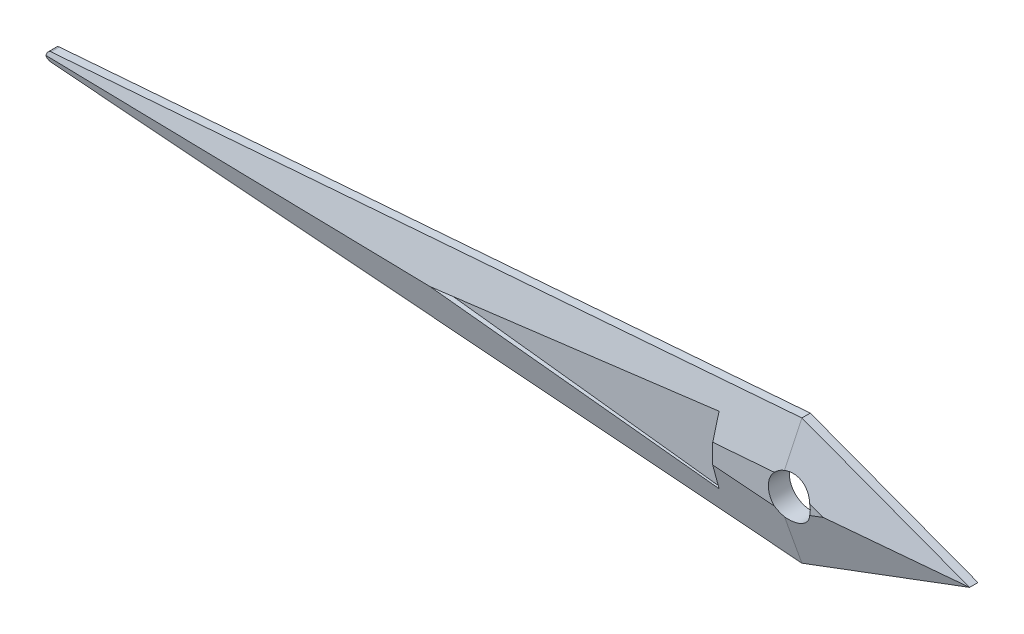
ISO-10303-21;
HEADER;
FILE_DESCRIPTION(('STEP AP214'),'2;1');
FILE_NAME('part.step','',(''),(''),'','','');
FILE_SCHEMA(('AUTOMOTIVE_DESIGN { 1 0 10303 214 1 1 1 1 }'));
ENDSEC;
DATA;
#1=APPLICATION_CONTEXT('core data for automotive mechanical design processes');
#2=APPLICATION_PROTOCOL_DEFINITION('international standard','automotive_design',2000,#1);
#3=PRODUCT_CONTEXT('',#1,'mechanical');
#4=PRODUCT('Part','Part','',(#3));
#5=PRODUCT_RELATED_PRODUCT_CATEGORY('part','',(#4));
#6=PRODUCT_DEFINITION_FORMATION('','',#4);
#7=PRODUCT_DEFINITION_CONTEXT('part definition',#1,'design');
#8=PRODUCT_DEFINITION('design','',#6,#7);
#9=PRODUCT_DEFINITION_SHAPE('','',#8);
#10=(LENGTH_UNIT() NAMED_UNIT(*) SI_UNIT(.MILLI.,.METRE.));
#11=(NAMED_UNIT(*) PLANE_ANGLE_UNIT() SI_UNIT($,.RADIAN.));
#12=(NAMED_UNIT(*) SI_UNIT($,.STERADIAN.) SOLID_ANGLE_UNIT());
#13=UNCERTAINTY_MEASURE_WITH_UNIT(LENGTH_MEASURE(1.E-05),#10,'distance_accuracy_value','');
#14=(GEOMETRIC_REPRESENTATION_CONTEXT(3) GLOBAL_UNCERTAINTY_ASSIGNED_CONTEXT((#13)) GLOBAL_UNIT_ASSIGNED_CONTEXT((#10,
#11,#12)) REPRESENTATION_CONTEXT('',''));
#15=CARTESIAN_POINT('',(0.,0.,0.));
#16=DIRECTION('',(0.,0.,1.));
#17=DIRECTION('',(1.,0.,0.));
#18=AXIS2_PLACEMENT_3D('',#15,#16,#17);
#19=CARTESIAN_POINT('',(-9.00000000000021,4.12500000000008,0.25));
#20=DIRECTION('',(0.,0.,-1.));
#21=DIRECTION('',(-1.,0.,0.));
#22=AXIS2_PLACEMENT_3D('',#19,#20,#21);
#23=PLANE('',#22);
#24=CARTESIAN_POINT('',(0.,0.,0.25));
#25=DIRECTION('',(0.,0.,1.));
#26=DIRECTION('',(1.,0.,0.));
#27=AXIS2_PLACEMENT_3D('',#24,#25,#26);
#28=CIRCLE('',#27,0.25);
#29=CARTESIAN_POINT('',(0.24238567910347,-0.0612305688814783,0.25));
#30=VERTEX_POINT('',#29);
#31=CARTESIAN_POINT('',(0.242385679103463,0.0612305688815068,0.25));
#32=VERTEX_POINT('',#31);
#33=EDGE_CURVE('E176',#30,#32,#28,.T.);
#34=ORIENTED_EDGE('',*,*,#33,.F.);
#35=DIRECTION('',(0.936329177569045,0.351123441588392,0.));
#36=VECTOR('',#35,1.);
#37=CARTESIAN_POINT('',(-6.48423281143733,-2.58371250283428,0.25));
#38=LINE('',#37,#36);
#39=CARTESIAN_POINT('',(0.405667196120782,0.,0.25));
#40=VERTEX_POINT('',#39);
#41=EDGE_CURVE('E220',#30,#40,#38,.T.);
#42=ORIENTED_EDGE('',*,*,#41,.T.);
#43=DIRECTION('',(-0.936329177569045,0.351123441588392,0.));
#44=VECTOR('',#43,1.);
#45=CARTESIAN_POINT('',(-9.19656157856066,3.60083579050555,0.25));
#46=LINE('',#45,#44);
#47=EDGE_CURVE('E200',#40,#32,#46,.T.);
#48=ORIENTED_EDGE('',*,*,#47,.T.);
#49=EDGE_LOOP('',(#34,#42,#48));
#50=FACE_BOUND('',#49,.T.);
#51=ADVANCED_FACE('F33',(#50),#23,.F.);
#52=CARTESIAN_POINT('',(0.,0.75,0.25));
#53=DIRECTION('',(-0.351123441588392,-0.936329177569045,0.));
#54=DIRECTION('',(0.936329177569045,-0.351123441588392,0.));
#55=AXIS2_PLACEMENT_3D('',#52,#53,#54);
#56=PLANE('',#55);
#57=DIRECTION('',(0.,0.,-1.));
#58=VECTOR('',#57,1.);
#59=CARTESIAN_POINT('',(0.,0.75,0.25));
#60=LINE('',#59,#58);
#61=CARTESIAN_POINT('',(0.,0.75,0.0999999999999996));
#62=VERTEX_POINT('',#61);
#63=CARTESIAN_POINT('',(0.,0.75,0.));
#64=VERTEX_POINT('',#63);
#65=EDGE_CURVE('E195',#62,#64,#60,.T.);
#66=ORIENTED_EDGE('',*,*,#65,.F.);
#67=DIRECTION('',(0.936329177569045,-0.351123441588392,0.));
#68=VECTOR('',#67,1.);
#69=CARTESIAN_POINT('',(0.,0.75,0.0999999999999996));
#70=LINE('',#69,#68);
#71=CARTESIAN_POINT('',(2.,0.,0.0999999999999996));
#72=VERTEX_POINT('',#71);
#73=EDGE_CURVE('E207',#62,#72,#70,.T.);
#74=ORIENTED_EDGE('',*,*,#73,.T.);
#75=DIRECTION('',(0.,0.,-1.));
#76=VECTOR('',#75,1.);
#77=CARTESIAN_POINT('',(2.,0.,0.25));
#78=LINE('',#77,#76);
#79=CARTESIAN_POINT('',(2.,0.,0.));
#80=VERTEX_POINT('',#79);
#81=EDGE_CURVE('E190',#72,#80,#78,.T.);
#82=ORIENTED_EDGE('',*,*,#81,.T.);
#83=DIRECTION('',(-0.936329177569045,0.351123441588392,0.));
#84=VECTOR('',#83,1.);
#85=CARTESIAN_POINT('',(0.,0.75,0.));
#86=LINE('',#85,#84);
#87=EDGE_CURVE('E172',#80,#64,#86,.T.);
#88=ORIENTED_EDGE('',*,*,#87,.T.);
#89=EDGE_LOOP('',(#66,#74,#82,#88));
#90=FACE_BOUND('',#89,.T.);
#91=ADVANCED_FACE('F319',(#90),#56,.F.);
#92=CARTESIAN_POINT('',(0.,0.75,0.25));
#93=DIRECTION('',(0.0775435860081924,-0.996988962962474,0.));
#94=DIRECTION('',(0.996988962962474,0.0775435860081924,0.));
#95=AXIS2_PLACEMENT_3D('',#92,#93,#94);
#96=PLANE('',#95);
#97=DIRECTION('',(-0.996988962962474,-0.0775435860081924,0.));
#98=VECTOR('',#97,1.);
#99=CARTESIAN_POINT('',(0.,0.75,0.));
#100=LINE('',#99,#98);
#101=CARTESIAN_POINT('',(-8.95387717930041,0.0535873304988575,0.));
#102=VERTEX_POINT('',#101);
#103=EDGE_CURVE('E179',#64,#102,#100,.T.);
#104=ORIENTED_EDGE('',*,*,#103,.T.);
#105=DIRECTION('',(0.,0.,-1.));
#106=VECTOR('',#105,1.);
#107=CARTESIAN_POINT('',(-8.95387717930041,0.0535873304988574,0.25));
#108=LINE('',#107,#106);
#109=CARTESIAN_POINT('',(-8.95387717930041,0.0535873304988574,0.0999999999999997));
#110=VERTEX_POINT('',#109);
#111=EDGE_CURVE('E249',#102,#110,#108,.F.);
#112=ORIENTED_EDGE('',*,*,#111,.T.);
#113=DIRECTION('',(0.996988962962474,0.0775435860081924,0.));
#114=VECTOR('',#113,1.);
#115=CARTESIAN_POINT('',(0.,0.75,0.0999999999999997));
#116=LINE('',#115,#114);
#117=EDGE_CURVE('E213',#110,#62,#116,.T.);
#118=ORIENTED_EDGE('',*,*,#117,.T.);
#119=ORIENTED_EDGE('',*,*,#65,.T.);
#120=EDGE_LOOP('',(#104,#112,#118,#119));
#121=FACE_BOUND('',#120,.T.);
#122=ADVANCED_FACE('F317',(#121),#96,.F.);
#123=CARTESIAN_POINT('',(-9.,0.05,0.25));
#124=DIRECTION('',(1.,0.,0.));
#125=DIRECTION('',(0.,1.,0.));
#126=AXIS2_PLACEMENT_3D('',#123,#124,#125);
#127=PLANE('',#126);
#128=DIRECTION('',(0.,-0.966120420192042,0.258091715651533));
#129=VECTOR('',#128,1.);
#130=CARTESIAN_POINT('',(-8.99999999999997,-0.48547609051918,0.243048361264322));
#131=LINE('',#130,#129);
#132=CARTESIAN_POINT('',(-9.,0.,0.113357119374425));
#133=VERTEX_POINT('',#132);
#134=CARTESIAN_POINT('',(-9.,0.00373788235073113,0.112358572559101));
#135=VERTEX_POINT('',#134);
#136=EDGE_CURVE('E210',#133,#135,#131,.F.);
#137=ORIENTED_EDGE('',*,*,#136,.T.);
#138=DIRECTION('',(0.,0.,-1.));
#139=VECTOR('',#138,1.);
#140=CARTESIAN_POINT('',(-9.,0.00373788235073116,0.25));
#141=LINE('',#140,#139);
#142=CARTESIAN_POINT('',(-9.,0.00373788235073116,0.));
#143=VERTEX_POINT('',#142);
#144=EDGE_CURVE('E242',#135,#143,#141,.T.);
#145=ORIENTED_EDGE('',*,*,#144,.T.);
#146=DIRECTION('',(0.,-1.,0.));
#147=VECTOR('',#146,1.);
#148=CARTESIAN_POINT('',(-9.,0.05,0.));
#149=LINE('',#148,#147);
#150=CARTESIAN_POINT('',(-9.,-0.00373788235073577,0.));
#151=VERTEX_POINT('',#150);
#152=EDGE_CURVE('E182',#143,#151,#149,.T.);
#153=ORIENTED_EDGE('',*,*,#152,.T.);
#154=DIRECTION('',(0.,0.,-1.));
#155=VECTOR('',#154,1.);
#156=CARTESIAN_POINT('',(-9.,-0.00373788235073577,0.25));
#157=LINE('',#156,#155);
#158=CARTESIAN_POINT('',(-9.,-0.00373788235073574,0.112358572559096));
#159=VERTEX_POINT('',#158);
#160=EDGE_CURVE('E238',#151,#159,#157,.F.);
#161=ORIENTED_EDGE('',*,*,#160,.T.);
#162=DIRECTION('',(0.,-0.966120420192044,-0.258091715651527));
#163=VECTOR('',#162,1.);
#164=CARTESIAN_POINT('',(-9.00000000000002,0.531778994968414,0.255417829706537));
#165=LINE('',#164,#163);
#166=EDGE_CURVE('E233',#159,#133,#165,.F.);
#167=ORIENTED_EDGE('',*,*,#166,.T.);
#168=EDGE_LOOP('',(#137,#145,#153,#161,#167));
#169=FACE_BOUND('',#168,.T.);
#170=ADVANCED_FACE('F316',(#169),#127,.F.);
#171=CARTESIAN_POINT('',(-8.99999999999999,-0.05,0.25));
#172=DIRECTION('',(0.0775435860081925,0.996988962962474,0.));
#173=DIRECTION('',(-0.996988962962474,0.0775435860081925,0.));
#174=AXIS2_PLACEMENT_3D('',#171,#172,#173);
#175=PLANE('',#174);
#176=DIRECTION('',(-0.996988962962474,0.0775435860081925,0.));
#177=VECTOR('',#176,1.);
#178=CARTESIAN_POINT('',(-8.99999999999999,-0.05,0.0999999999999961));
#179=LINE('',#178,#177);
#180=CARTESIAN_POINT('',(0.,-0.75,0.0999999999999961));
#181=VERTEX_POINT('',#180);
#182=CARTESIAN_POINT('',(-8.95387717930041,-0.0535873304988569,0.0999999999999961));
#183=VERTEX_POINT('',#182);
#184=EDGE_CURVE('E231',#181,#183,#179,.T.);
#185=ORIENTED_EDGE('',*,*,#184,.T.);
#186=DIRECTION('',(0.,0.,-1.));
#187=VECTOR('',#186,1.);
#188=CARTESIAN_POINT('',(-8.95387717930041,-0.0535873304988569,0.25));
#189=LINE('',#188,#187);
#190=CARTESIAN_POINT('',(-8.95387717930041,-0.0535873304988569,0.));
#191=VERTEX_POINT('',#190);
#192=EDGE_CURVE('E253',#183,#191,#189,.T.);
#193=ORIENTED_EDGE('',*,*,#192,.T.);
#194=DIRECTION('',(0.996988962962474,-0.0775435860081925,0.));
#195=VECTOR('',#194,1.);
#196=CARTESIAN_POINT('',(-8.99999999999999,-0.05,0.));
#197=LINE('',#196,#195);
#198=CARTESIAN_POINT('',(0.,-0.75,0.));
#199=VERTEX_POINT('',#198);
#200=EDGE_CURVE('E185',#191,#199,#197,.T.);
#201=ORIENTED_EDGE('',*,*,#200,.T.);
#202=DIRECTION('',(0.,0.,-1.));
#203=VECTOR('',#202,1.);
#204=CARTESIAN_POINT('',(0.,-0.75,0.25));
#205=LINE('',#204,#203);
#206=EDGE_CURVE('E192',#181,#199,#205,.T.);
#207=ORIENTED_EDGE('',*,*,#206,.F.);
#208=EDGE_LOOP('',(#185,#193,#201,#207));
#209=FACE_BOUND('',#208,.T.);
#210=ADVANCED_FACE('F287',(#209),#175,.F.);
#211=CARTESIAN_POINT('',(0.,-0.75,0.25));
#212=DIRECTION('',(-0.351123441588392,0.936329177569045,0.));
#213=DIRECTION('',(-0.936329177569045,-0.351123441588392,0.));
#214=AXIS2_PLACEMENT_3D('',#211,#212,#213);
#215=PLANE('',#214);
#216=ORIENTED_EDGE('',*,*,#81,.F.);
#217=DIRECTION('',(-0.936329177569045,-0.351123441588392,0.));
#218=VECTOR('',#217,1.);
#219=CARTESIAN_POINT('',(0.,-0.75,0.0999999999999962));
#220=LINE('',#219,#218);
#221=EDGE_CURVE('E225',#72,#181,#220,.T.);
#222=ORIENTED_EDGE('',*,*,#221,.T.);
#223=ORIENTED_EDGE('',*,*,#206,.T.);
#224=DIRECTION('',(0.936329177569045,0.351123441588392,0.));
#225=VECTOR('',#224,1.);
#226=CARTESIAN_POINT('',(0.,-0.75,0.));
#227=LINE('',#226,#225);
#228=EDGE_CURVE('E187',#199,#80,#227,.T.);
#229=ORIENTED_EDGE('',*,*,#228,.T.);
#230=EDGE_LOOP('',(#216,#222,#223,#229));
#231=FACE_BOUND('',#230,.T.);
#232=ADVANCED_FACE('F297',(#231),#215,.F.);
#233=DIRECTION('',(-0.996988962962475,-0.0775435860081924,0.));
#234=VECTOR('',#233,1.);
#235=CARTESIAN_POINT('',(-8.64155185453296,-0.483619013150354,0.25));
#236=LINE('',#235,#234);
#237=CARTESIAN_POINT('',(-0.178942593003148,0.174583929413075,0.25));
#238=VERTEX_POINT('',#237);
#239=CARTESIAN_POINT('',(-0.9129809087602,0.117492060409749,0.25));
#240=VERTEX_POINT('',#239);
#241=EDGE_CURVE('E197',#238,#240,#236,.T.);
#242=ORIENTED_EDGE('',*,*,#241,.T.);
#243=DIRECTION('',(0.,1.,0.));
#244=VECTOR('',#243,1.);
#245=CARTESIAN_POINT('',(-0.912980908760202,0.4,0.25));
#246=LINE('',#245,#244);
#247=CARTESIAN_POINT('',(-0.912980908760202,-0.117492060409726,0.25));
#248=VERTEX_POINT('',#247);
#249=EDGE_CURVE('E158',#248,#240,#246,.T.);
#250=ORIENTED_EDGE('',*,*,#249,.F.);
#251=DIRECTION('',(0.996988962962475,-0.0775435860081925,0.));
#252=VECTOR('',#251,1.);
#253=CARTESIAN_POINT('',(-9.27936017457223,0.53322632693121,0.25));
#254=LINE('',#253,#252);
#255=CARTESIAN_POINT('',(-0.178942593003172,-0.174583929413051,0.25));
#256=VERTEX_POINT('',#255);
#257=EDGE_CURVE('E215',#248,#256,#254,.T.);
#258=ORIENTED_EDGE('',*,*,#257,.T.);
#259=EDGE_CURVE('E173',#238,#256,#28,.T.);
#260=ORIENTED_EDGE('',*,*,#259,.F.);
#261=EDGE_LOOP('',(#242,#250,#258,#260));
#262=FACE_BOUND('',#261,.T.);
#263=ADVANCED_FACE('F265',(#262),#23,.F.);
#264=CARTESIAN_POINT('',(-9.00000000000021,4.12500000000008,0.));
#265=DIRECTION('',(0.,0.,-1.));
#266=DIRECTION('',(-1.,0.,0.));
#267=AXIS2_PLACEMENT_3D('',#264,#265,#266);
#268=PLANE('',#267);
#269=CARTESIAN_POINT('',(0.,0.,0.));
#270=DIRECTION('',(0.,0.,1.));
#271=DIRECTION('',(1.,0.,0.));
#272=AXIS2_PLACEMENT_3D('',#269,#270,#271);
#273=CIRCLE('',#272,0.25);
#274=CARTESIAN_POINT('',(0.25,0.,0.));
#275=VERTEX_POINT('',#274);
#276=EDGE_CURVE('E169',#275,#275,#273,.T.);
#277=ORIENTED_EDGE('',*,*,#276,.T.);
#278=EDGE_LOOP('',(#277));
#279=FACE_BOUND('',#278,.T.);
#280=ORIENTED_EDGE('',*,*,#152,.F.);
#281=CARTESIAN_POINT('',(-8.95,0.00373788235073377,0.));
#282=DIRECTION('',(0.,0.,-1.));
#283=DIRECTION('',(-1.,0.,0.));
#284=AXIS2_PLACEMENT_3D('',#281,#282,#283);
#285=CIRCLE('',#284,0.05);
#286=EDGE_CURVE('E247',#143,#102,#285,.T.);
#287=ORIENTED_EDGE('',*,*,#286,.T.);
#288=ORIENTED_EDGE('',*,*,#103,.F.);
#289=ORIENTED_EDGE('',*,*,#87,.F.);
#290=ORIENTED_EDGE('',*,*,#228,.F.);
#291=ORIENTED_EDGE('',*,*,#200,.F.);
#292=CARTESIAN_POINT('',(-8.95,-0.00373788235073317,0.));
#293=DIRECTION('',(0.,0.,-1.));
#294=DIRECTION('',(-1.,0.,0.));
#295=AXIS2_PLACEMENT_3D('',#292,#293,#294);
#296=CIRCLE('',#295,0.05);
#297=EDGE_CURVE('E245',#191,#151,#296,.T.);
#298=ORIENTED_EDGE('',*,*,#297,.T.);
#299=EDGE_LOOP('',(#280,#287,#288,#289,#290,#291,#298));
#300=FACE_BOUND('',#299,.T.);
#301=ADVANCED_FACE('F292',(#279,#300),#268,.T.);
#302=CARTESIAN_POINT('',(0.,0.,0.));
#303=DIRECTION('',(0.,0.,1.));
#304=DIRECTION('',(1.,0.,0.));
#305=AXIS2_PLACEMENT_3D('',#302,#303,#304);
#306=CYLINDRICAL_SURFACE('',#305,0.25);
#307=ORIENTED_EDGE('',*,*,#276,.F.);
#308=EDGE_LOOP('',(#307));
#309=FACE_BOUND('',#308,.T.);
#310=CARTESIAN_POINT('',(0.,0.,0.300356790616396));
#311=DIRECTION('',(0.0200697568844653,0.258039731371697,-0.965925826289069));
#312=DIRECTION('',(0.0749013523883808,0.96301738785061,0.258819045102517));
#313=AXIS2_PLACEMENT_3D('',#310,#311,#312);
#314=ELLIPSE('',#313,0.258819045102521,0.25);
#315=CARTESIAN_POINT('',(-0.0722641388199196,-0.239328005550156,0.234920650242869));
#316=VERTEX_POINT('',#315);
#317=EDGE_CURVE('E227',#256,#316,#314,.F.);
#318=ORIENTED_EDGE('',*,*,#317,.T.);
#319=CARTESIAN_POINT('',(0.,0.,0.288166485234486));
#320=DIRECTION('',(-0.090877433865017,0.242339823640045,-0.965925826289069));
#321=DIRECTION('',(-0.339159200445729,0.904424534521944,0.258819045102517));
#322=AXIS2_PLACEMENT_3D('',#319,#320,#321);
#323=ELLIPSE('',#322,0.258819045102521,0.25);
#324=EDGE_CURVE('E229',#316,#30,#323,.F.);
#325=ORIENTED_EDGE('',*,*,#324,.T.);
#326=ORIENTED_EDGE('',*,*,#33,.T.);
#327=CARTESIAN_POINT('',(0.,0.,0.288166485234493));
#328=DIRECTION('',(-0.0908774338650187,-0.24233982364005,-0.965925826289068));
#329=DIRECTION('',(-0.339159200445728,-0.904424534521943,0.258819045102522));
#330=AXIS2_PLACEMENT_3D('',#327,#328,#329);
#331=ELLIPSE('',#330,0.258819045102521,0.25);
#332=CARTESIAN_POINT('',(-0.0722641388199188,0.239328005550156,0.234920650242875));
#333=VERTEX_POINT('',#332);
#334=EDGE_CURVE('E205',#32,#333,#331,.F.);
#335=ORIENTED_EDGE('',*,*,#334,.T.);
#336=CARTESIAN_POINT('',(0.,0.,0.300356790616403));
#337=DIRECTION('',(0.0200697568844656,-0.258039731371701,-0.965925826289068));
#338=DIRECTION('',(0.0749013523883807,-0.963017387850609,0.258819045102521));
#339=AXIS2_PLACEMENT_3D('',#336,#337,#338);
#340=ELLIPSE('',#339,0.258819045102521,0.25);
#341=EDGE_CURVE('E203',#333,#238,#340,.F.);
#342=ORIENTED_EDGE('',*,*,#341,.T.);
#343=ORIENTED_EDGE('',*,*,#259,.T.);
#344=EDGE_LOOP('',(#318,#325,#326,#335,#342,#343));
#345=FACE_BOUND('',#344,.T.);
#346=ADVANCED_FACE('F273',(#309,#345),#306,.F.);
#347=CARTESIAN_POINT('',(-8.64155185453296,-0.483619013150354,0.25));
#348=DIRECTION('',(0.0200697568844656,-0.258039731371701,-0.965925826289068));
#349=DIRECTION('',(0.,0.966120420192042,-0.258091715651532));
#350=AXIS2_PLACEMENT_3D('',#347,#348,#349);
#351=PLANE('',#350);
#352=DIRECTION('',(0.993139757428316,0.116463101687925,-0.0104770301351846));
#353=VECTOR('',#352,1.);
#354=CARTESIAN_POINT('',(-8.63886414652736,-0.505995675250222,0.256033599438876));
#355=LINE('',#354,#353);
#356=CARTESIAN_POINT('',(-0.912980908760202,0.4,0.174530154533393));
#357=VERTEX_POINT('',#356);
#358=CARTESIAN_POINT('',(-4.32398316796351,0.,0.210514187186954));
#359=VERTEX_POINT('',#358);
#360=EDGE_CURVE('E11',#357,#359,#355,.F.);
#361=ORIENTED_EDGE('',*,*,#360,.F.);
#362=DIRECTION('',(0.,-0.966120420192042,0.258091715651532));
#363=VECTOR('',#362,1.);
#364=CARTESIAN_POINT('',(-0.912980908760202,-0.44357820284592,0.399885649674942));
#365=LINE('',#364,#363);
#366=EDGE_CURVE('E165',#240,#357,#365,.F.);
#367=ORIENTED_EDGE('',*,*,#366,.F.);
#368=ORIENTED_EDGE('',*,*,#241,.F.);
#369=ORIENTED_EDGE('',*,*,#341,.F.);
#370=DIRECTION('',(0.135550758455892,0.957902180808685,-0.253079836976392));
#371=VECTOR('',#370,1.);
#372=CARTESIAN_POINT('',(-0.324104198553258,-1.54036061575736,0.705118249927849));
#373=LINE('',#372,#371);
#374=EDGE_CURVE('E216',#62,#333,#373,.F.);
#375=ORIENTED_EDGE('',*,*,#374,.F.);
#376=ORIENTED_EDGE('',*,*,#117,.F.);
#377=CARTESIAN_POINT('',(-8.95,0.00373788235073377,0.113397459621556));
#378=DIRECTION('',(0.0200697568844656,-0.258039731371701,-0.965925826289068));
#379=DIRECTION('',(-0.0749013523883807,0.963017387850609,-0.258819045102521));
#380=AXIS2_PLACEMENT_3D('',#377,#378,#379);
#381=ELLIPSE('',#380,0.0517638090205042,0.05);
#382=EDGE_CURVE('E251',#110,#135,#381,.F.);
#383=ORIENTED_EDGE('',*,*,#382,.T.);
#384=ORIENTED_EDGE('',*,*,#136,.F.);
#385=DIRECTION('',(0.999784212600696,0.,0.0207732576743608));
#386=VECTOR('',#385,1.);
#387=CARTESIAN_POINT('',(-8.63886862977606,0.,0.120860613541874));
#388=LINE('',#387,#386);
#389=EDGE_CURVE('E235',#133,#359,#388,.T.);
#390=ORIENTED_EDGE('',*,*,#389,.T.);
#391=EDGE_LOOP('',(#361,#367,#368,#369,#375,#376,#383,#384,#390));
#392=FACE_BOUND('',#391,.T.);
#393=ADVANCED_FACE('F277',(#392),#351,.F.);
#394=CARTESIAN_POINT('',(-9.19656157856066,3.60083579050555,0.25));
#395=DIRECTION('',(-0.0908774338650187,-0.24233982364005,-0.965925826289068));
#396=DIRECTION('',(0.,0.969939353046098,-0.243346771937737));
#397=AXIS2_PLACEMENT_3D('',#394,#395,#396);
#398=PLANE('',#397);
#399=ORIENTED_EDGE('',*,*,#47,.F.);
#400=DIRECTION('',(0.995603338596182,0.,-0.0936695904556844));
#401=VECTOR('',#400,1.);
#402=CARTESIAN_POINT('',(-9.11231169841815,0.,1.14548231756073));
#403=LINE('',#402,#401);
#404=EDGE_CURVE('E223',#40,#72,#403,.T.);
#405=ORIENTED_EDGE('',*,*,#404,.T.);
#406=ORIENTED_EDGE('',*,*,#73,.F.);
#407=ORIENTED_EDGE('',*,*,#374,.T.);
#408=ORIENTED_EDGE('',*,*,#334,.F.);
#409=EDGE_LOOP('',(#399,#405,#406,#407,#408));
#410=FACE_BOUND('',#409,.T.);
#411=ADVANCED_FACE('F306',(#410),#398,.F.);
#412=CARTESIAN_POINT('',(-9.27936017457223,0.53322632693121,0.25));
#413=DIRECTION('',(0.0200697568844653,0.258039731371697,-0.965925826289069));
#414=DIRECTION('',(0.,0.966120420192044,0.258091715651528));
#415=AXIS2_PLACEMENT_3D('',#412,#413,#414);
#416=PLANE('',#415);
#417=DIRECTION('',(0.,-0.966120420192044,-0.258091715651528));
#418=VECTOR('',#417,1.);
#419=CARTESIAN_POINT('',(-0.912980908760202,0.489881107295159,0.412255118117157));
#420=LINE('',#419,#418);
#421=CARTESIAN_POINT('',(-0.912980908760201,-0.4,0.174530154533388));
#422=VERTEX_POINT('',#421);
#423=EDGE_CURVE('E41',#422,#248,#420,.F.);
#424=ORIENTED_EDGE('',*,*,#423,.F.);
#425=DIRECTION('',(-0.993139757428316,0.116463101687925,0.0104770301351845));
#426=VECTOR('',#425,1.);
#427=CARTESIAN_POINT('',(-9.27368923122986,0.580440080320865,0.262730624196213));
#428=LINE('',#427,#426);
#429=EDGE_CURVE('E257',#359,#422,#428,.F.);
#430=ORIENTED_EDGE('',*,*,#429,.F.);
#431=ORIENTED_EDGE('',*,*,#389,.F.);
#432=ORIENTED_EDGE('',*,*,#166,.F.);
#433=CARTESIAN_POINT('',(-8.95,-0.00373788235073317,0.113397459621552));
#434=DIRECTION('',(0.0200697568844653,0.258039731371697,-0.965925826289069));
#435=DIRECTION('',(-0.0749013523883808,-0.96301738785061,-0.258819045102517));
#436=AXIS2_PLACEMENT_3D('',#433,#434,#435);
#437=ELLIPSE('',#436,0.0517638090205041,0.05);
#438=EDGE_CURVE('E55',#159,#183,#437,.F.);
#439=ORIENTED_EDGE('',*,*,#438,.T.);
#440=ORIENTED_EDGE('',*,*,#184,.F.);
#441=DIRECTION('',(-0.135550758455901,0.957902180808685,0.253079836976388));
#442=VECTOR('',#441,1.);
#443=CARTESIAN_POINT('',(-0.342264524066546,1.66869494314526,0.739024457998461));
#444=LINE('',#443,#442);
#445=EDGE_CURVE('E168',#316,#181,#444,.F.);
#446=ORIENTED_EDGE('',*,*,#445,.F.);
#447=ORIENTED_EDGE('',*,*,#317,.F.);
#448=ORIENTED_EDGE('',*,*,#257,.F.);
#449=EDGE_LOOP('',(#424,#430,#431,#432,#439,#440,#446,#447,#448));
#450=FACE_BOUND('',#449,.T.);
#451=ADVANCED_FACE('F269',(#450),#416,.F.);
#452=CARTESIAN_POINT('',(-6.48423281143733,-2.58371250283428,0.25));
#453=DIRECTION('',(-0.090877433865017,0.242339823640045,-0.965925826289069));
#454=DIRECTION('',(0.,0.969939353046099,0.243346771937732));
#455=AXIS2_PLACEMENT_3D('',#452,#453,#454);
#456=PLANE('',#455);
#457=ORIENTED_EDGE('',*,*,#445,.T.);
#458=ORIENTED_EDGE('',*,*,#221,.F.);
#459=ORIENTED_EDGE('',*,*,#404,.F.);
#460=ORIENTED_EDGE('',*,*,#41,.F.);
#461=ORIENTED_EDGE('',*,*,#324,.F.);
#462=EDGE_LOOP('',(#457,#458,#459,#460,#461));
#463=FACE_BOUND('',#462,.T.);
#464=ADVANCED_FACE('F300',(#463),#456,.F.);
#465=CARTESIAN_POINT('',(-8.95,0.00373788235073377,0.25));
#466=DIRECTION('',(0.,0.,-1.));
#467=DIRECTION('',(-1.,0.,0.));
#468=AXIS2_PLACEMENT_3D('',#465,#466,#467);
#469=CYLINDRICAL_SURFACE('',#468,0.05);
#470=ORIENTED_EDGE('',*,*,#382,.F.);
#471=ORIENTED_EDGE('',*,*,#111,.F.);
#472=ORIENTED_EDGE('',*,*,#286,.F.);
#473=ORIENTED_EDGE('',*,*,#144,.F.);
#474=EDGE_LOOP('',(#470,#471,#472,#473));
#475=FACE_BOUND('',#474,.T.);
#476=ADVANCED_FACE('F315',(#475),#469,.T.);
#477=CARTESIAN_POINT('',(-8.95,-0.00373788235073317,0.25));
#478=DIRECTION('',(0.,0.,-1.));
#479=DIRECTION('',(-1.,0.,0.));
#480=AXIS2_PLACEMENT_3D('',#477,#478,#479);
#481=CYLINDRICAL_SURFACE('',#480,0.05);
#482=ORIENTED_EDGE('',*,*,#438,.F.);
#483=ORIENTED_EDGE('',*,*,#160,.F.);
#484=ORIENTED_EDGE('',*,*,#297,.F.);
#485=ORIENTED_EDGE('',*,*,#192,.F.);
#486=EDGE_LOOP('',(#482,#483,#484,#485));
#487=FACE_BOUND('',#486,.T.);
#488=ADVANCED_FACE('F35',(#487),#481,.T.);
#489=CARTESIAN_POINT('',(-4.32398316796343,0.,0.15));
#490=DIRECTION('',(-0.116469494184415,0.993194269478246,0.));
#491=DIRECTION('',(-0.993194269478246,-0.116469494184415,0.));
#492=AXIS2_PLACEMENT_3D('',#489,#490,#491);
#493=PLANE('',#492);
#494=ORIENTED_EDGE('',*,*,#360,.T.);
#495=DIRECTION('',(0.,0.,1.));
#496=VECTOR('',#495,1.);
#497=CARTESIAN_POINT('',(-4.32398316796343,0.,0.15));
#498=LINE('',#497,#496);
#499=CARTESIAN_POINT('',(-4.32398316796343,0.,0.15));
#500=VERTEX_POINT('',#499);
#501=EDGE_CURVE('E48',#500,#359,#498,.T.);
#502=ORIENTED_EDGE('',*,*,#501,.F.);
#503=DIRECTION('',(-0.993194269478246,-0.116469494184415,0.));
#504=VECTOR('',#503,1.);
#505=CARTESIAN_POINT('',(-4.32398316796343,0.,0.15));
#506=LINE('',#505,#504);
#507=CARTESIAN_POINT('',(-0.912980908760202,0.4,0.15));
#508=VERTEX_POINT('',#507);
#509=EDGE_CURVE('E143',#508,#500,#506,.T.);
#510=ORIENTED_EDGE('',*,*,#509,.F.);
#511=DIRECTION('',(0.,0.,1.));
#512=VECTOR('',#511,1.);
#513=CARTESIAN_POINT('',(-0.912980908760202,0.4,0.15));
#514=LINE('',#513,#512);
#515=EDGE_CURVE('E163',#508,#357,#514,.T.);
#516=ORIENTED_EDGE('',*,*,#515,.T.);
#517=EDGE_LOOP('',(#494,#502,#510,#516));
#518=FACE_BOUND('',#517,.T.);
#519=ADVANCED_FACE('F140',(#518),#493,.F.);
#520=CARTESIAN_POINT('',(-0.912980908760202,0.4,0.15));
#521=DIRECTION('',(1.,0.,0.));
#522=DIRECTION('',(0.,0.,-1.));
#523=AXIS2_PLACEMENT_3D('',#520,#521,#522);
#524=PLANE('',#523);
#525=ORIENTED_EDGE('',*,*,#366,.T.);
#526=ORIENTED_EDGE('',*,*,#515,.F.);
#527=DIRECTION('',(0.,1.,0.));
#528=VECTOR('',#527,1.);
#529=CARTESIAN_POINT('',(-0.912980908760202,0.4,0.15));
#530=LINE('',#529,#528);
#531=CARTESIAN_POINT('',(-0.912980908760202,-0.4,0.15));
#532=VERTEX_POINT('',#531);
#533=EDGE_CURVE('E148',#532,#508,#530,.T.);
#534=ORIENTED_EDGE('',*,*,#533,.F.);
#535=DIRECTION('',(0.,0.,1.));
#536=VECTOR('',#535,1.);
#537=CARTESIAN_POINT('',(-0.912980908760202,-0.4,0.15));
#538=LINE('',#537,#536);
#539=EDGE_CURVE('E147',#532,#422,#538,.T.);
#540=ORIENTED_EDGE('',*,*,#539,.T.);
#541=ORIENTED_EDGE('',*,*,#423,.T.);
#542=ORIENTED_EDGE('',*,*,#249,.T.);
#543=EDGE_LOOP('',(#525,#526,#534,#540,#541,#542));
#544=FACE_BOUND('',#543,.T.);
#545=ADVANCED_FACE('F261',(#544),#524,.F.);
#546=CARTESIAN_POINT('',(-0.912980908760202,-0.4,0.15));
#547=DIRECTION('',(-0.116469494184415,-0.993194269478246,0.));
#548=DIRECTION('',(0.993194269478246,-0.116469494184415,0.));
#549=AXIS2_PLACEMENT_3D('',#546,#547,#548);
#550=PLANE('',#549);
#551=ORIENTED_EDGE('',*,*,#429,.T.);
#552=ORIENTED_EDGE('',*,*,#539,.F.);
#553=DIRECTION('',(0.993194269478246,-0.116469494184415,0.));
#554=VECTOR('',#553,1.);
#555=CARTESIAN_POINT('',(-0.912980908760202,-0.4,0.15));
#556=LINE('',#555,#554);
#557=EDGE_CURVE('E151',#500,#532,#556,.T.);
#558=ORIENTED_EDGE('',*,*,#557,.F.);
#559=ORIENTED_EDGE('',*,*,#501,.T.);
#560=EDGE_LOOP('',(#551,#552,#558,#559));
#561=FACE_BOUND('',#560,.T.);
#562=ADVANCED_FACE('F152',(#561),#550,.F.);
#563=CARTESIAN_POINT('',(-0.912980908760202,0.4,0.15));
#564=DIRECTION('',(0.,0.,-1.));
#565=DIRECTION('',(-1.,0.,0.));
#566=AXIS2_PLACEMENT_3D('',#563,#564,#565);
#567=PLANE('',#566);
#568=ORIENTED_EDGE('',*,*,#509,.T.);
#569=ORIENTED_EDGE('',*,*,#557,.T.);
#570=ORIENTED_EDGE('',*,*,#533,.T.);
#571=EDGE_LOOP('',(#568,#569,#570));
#572=FACE_BOUND('',#571,.T.);
#573=ADVANCED_FACE('F157',(#572),#567,.F.);
#574=CLOSED_SHELL('',(#51,#91,#122,#170,#210,#232,#263,#301,#346,#393,#411,#451,#464,#476,#488,
#519,#545,#562,#573));
#575=MANIFOLD_SOLID_BREP('B2',#574);
#576=ADVANCED_BREP_SHAPE_REPRESENTATION('',(#18,#575),#14);
#577=SHAPE_DEFINITION_REPRESENTATION(#9,#576);
ENDSEC;
END-ISO-10303-21;
